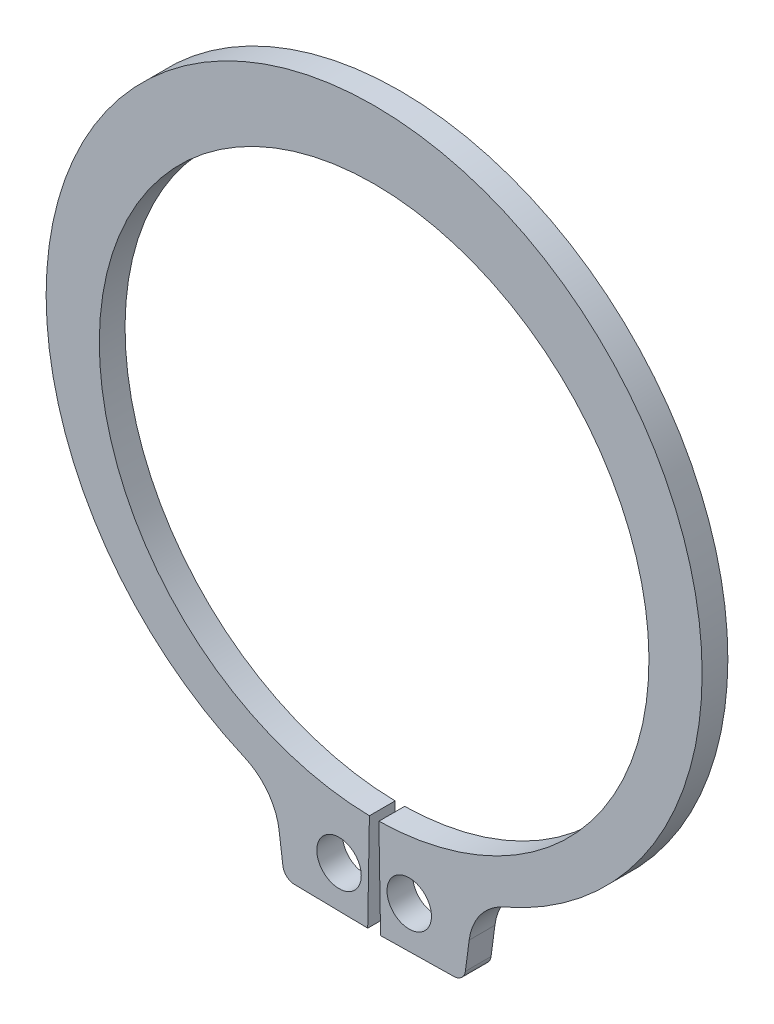
ISO-10303-21;
HEADER;
FILE_DESCRIPTION(('STEP AP214'),'2;1');
FILE_NAME('part.step','',(''),(''),'','','');
FILE_SCHEMA(('AUTOMOTIVE_DESIGN { 1 0 10303 214 1 1 1 1 }'));
ENDSEC;
DATA;
#1=APPLICATION_CONTEXT('core data for automotive mechanical design processes');
#2=APPLICATION_PROTOCOL_DEFINITION('international standard','automotive_design',2000,#1);
#3=PRODUCT_CONTEXT('',#1,'mechanical');
#4=PRODUCT('Part','Part','',(#3));
#5=PRODUCT_RELATED_PRODUCT_CATEGORY('part','',(#4));
#6=PRODUCT_DEFINITION_FORMATION('','',#4);
#7=PRODUCT_DEFINITION_CONTEXT('part definition',#1,'design');
#8=PRODUCT_DEFINITION('design','',#6,#7);
#9=PRODUCT_DEFINITION_SHAPE('','',#8);
#10=(LENGTH_UNIT() NAMED_UNIT(*) SI_UNIT(.MILLI.,.METRE.));
#11=(NAMED_UNIT(*) PLANE_ANGLE_UNIT() SI_UNIT($,.RADIAN.));
#12=(NAMED_UNIT(*) SI_UNIT($,.STERADIAN.) SOLID_ANGLE_UNIT());
#13=UNCERTAINTY_MEASURE_WITH_UNIT(LENGTH_MEASURE(1.E-05),#10,'distance_accuracy_value','');
#14=(GEOMETRIC_REPRESENTATION_CONTEXT(3) GLOBAL_UNCERTAINTY_ASSIGNED_CONTEXT((#13)) GLOBAL_UNIT_ASSIGNED_CONTEXT((#10,
#11,#12)) REPRESENTATION_CONTEXT('',''));
#15=CARTESIAN_POINT('',(0.,0.,0.));
#16=DIRECTION('',(0.,0.,1.));
#17=DIRECTION('',(1.,0.,0.));
#18=AXIS2_PLACEMENT_3D('',#15,#16,#17);
#19=CARTESIAN_POINT('',(0.,0.,-1.1));
#20=DIRECTION('',(0.,0.,1.));
#21=DIRECTION('',(1.,0.,0.));
#22=AXIS2_PLACEMENT_3D('',#19,#20,#21);
#23=CYLINDRICAL_SURFACE('',#22,11.75);
#24=CARTESIAN_POINT('',(0.,0.,0.));
#25=DIRECTION('',(0.,0.,-1.));
#26=DIRECTION('',(1.,0.,0.));
#27=AXIS2_PLACEMENT_3D('',#24,#25,#26);
#28=CIRCLE('',#27,11.75);
#29=CARTESIAN_POINT('',(-0.202586206896552,-11.7482534373742,0.));
#30=VERTEX_POINT('',#29);
#31=CARTESIAN_POINT('',(0.202586206896552,-11.7482534373742,0.));
#32=VERTEX_POINT('',#31);
#33=EDGE_CURVE('E155',#30,#32,#28,.T.);
#34=ORIENTED_EDGE('',*,*,#33,.F.);
#35=DIRECTION('',(0.,0.,1.));
#36=VECTOR('',#35,1.);
#37=CARTESIAN_POINT('',(-0.202586206896552,-11.7482534373742,-1.1));
#38=LINE('',#37,#36);
#39=CARTESIAN_POINT('',(-0.202586206896552,-11.7482534373742,-1.1));
#40=VERTEX_POINT('',#39);
#41=EDGE_CURVE('E11',#40,#30,#38,.T.);
#42=ORIENTED_EDGE('',*,*,#41,.F.);
#43=CARTESIAN_POINT('',(0.,0.,-1.1));
#44=DIRECTION('',(0.,0.,-1.));
#45=DIRECTION('',(1.,0.,0.));
#46=AXIS2_PLACEMENT_3D('',#43,#44,#45);
#47=CIRCLE('',#46,11.75);
#48=CARTESIAN_POINT('',(0.202586206896552,-11.7482534373742,-1.1));
#49=VERTEX_POINT('',#48);
#50=EDGE_CURVE('E188',#40,#49,#47,.T.);
#51=ORIENTED_EDGE('',*,*,#50,.T.);
#52=DIRECTION('',(0.,0.,1.));
#53=VECTOR('',#52,1.);
#54=CARTESIAN_POINT('',(0.202586206896552,-11.7482534373742,-1.1));
#55=LINE('',#54,#53);
#56=EDGE_CURVE('E37',#49,#32,#55,.T.);
#57=ORIENTED_EDGE('',*,*,#56,.T.);
#58=EDGE_LOOP('',(#34,#42,#51,#57));
#59=FACE_BOUND('',#58,.T.);
#60=ADVANCED_FACE('F34',(#59),#23,.F.);
#61=CARTESIAN_POINT('',(-0.202586206896552,-11.7482534373742,-1.1));
#62=DIRECTION('',(0.999851356372275,-0.0172413793103448,0.));
#63=DIRECTION('',(0.0172413793103448,0.999851356372275,0.));
#64=AXIS2_PLACEMENT_3D('',#61,#62,#63);
#65=PLANE('',#64);
#66=DIRECTION('',(0.0172413793103448,0.999851356372274,0.));
#67=VECTOR('',#66,1.);
#68=CARTESIAN_POINT('',(-0.202586206896552,-11.7482534373742,0.));
#69=LINE('',#68,#67);
#70=CARTESIAN_POINT('',(-0.275,-15.9476291341378,0.));
#71=VERTEX_POINT('',#70);
#72=EDGE_CURVE('E186',#71,#30,#69,.T.);
#73=ORIENTED_EDGE('',*,*,#72,.F.);
#74=DIRECTION('',(0.,0.,1.));
#75=VECTOR('',#74,1.);
#76=CARTESIAN_POINT('',(-0.275,-15.9476291341378,-1.1));
#77=LINE('',#76,#75);
#78=CARTESIAN_POINT('',(-0.275,-15.9476291341378,-1.1));
#79=VERTEX_POINT('',#78);
#80=EDGE_CURVE('E43',#79,#71,#77,.T.);
#81=ORIENTED_EDGE('',*,*,#80,.F.);
#82=DIRECTION('',(0.0172413793103448,0.999851356372274,0.));
#83=VECTOR('',#82,1.);
#84=CARTESIAN_POINT('',(-0.202586206896552,-11.7482534373742,-1.1));
#85=LINE('',#84,#83);
#86=EDGE_CURVE('E145',#79,#40,#85,.T.);
#87=ORIENTED_EDGE('',*,*,#86,.T.);
#88=ORIENTED_EDGE('',*,*,#41,.T.);
#89=EDGE_LOOP('',(#73,#81,#87,#88));
#90=FACE_BOUND('',#89,.T.);
#91=ADVANCED_FACE('F208',(#90),#65,.T.);
#92=CARTESIAN_POINT('',(-0.275,-15.9476291341378,-1.1));
#93=DIRECTION('',(-0.0172413793103457,-0.999851356372274,0.));
#94=DIRECTION('',(0.999851356372274,-0.0172413793103457,0.));
#95=AXIS2_PLACEMENT_3D('',#92,#93,#94);
#96=PLANE('',#95);
#97=DIRECTION('',(0.999851356372275,-0.0172413793103457,0.));
#98=VECTOR('',#97,1.);
#99=CARTESIAN_POINT('',(-0.275,-15.9476291341378,0.));
#100=LINE('',#99,#98);
#101=CARTESIAN_POINT('',(-3.41293614914244,-15.893518743574,0.));
#102=VERTEX_POINT('',#101);
#103=EDGE_CURVE('E132',#102,#71,#100,.T.);
#104=ORIENTED_EDGE('',*,*,#103,.F.);
#105=DIRECTION('',(0.,0.,1.));
#106=VECTOR('',#105,1.);
#107=CARTESIAN_POINT('',(-3.41293614914244,-15.893518743574,-1.1));
#108=LINE('',#107,#106);
#109=CARTESIAN_POINT('',(-3.41293614914244,-15.893518743574,-1.1));
#110=VERTEX_POINT('',#109);
#111=EDGE_CURVE('E127',#110,#102,#108,.T.);
#112=ORIENTED_EDGE('',*,*,#111,.F.);
#113=DIRECTION('',(0.999851356372275,-0.0172413793103457,0.));
#114=VECTOR('',#113,1.);
#115=CARTESIAN_POINT('',(-0.275,-15.9476291341378,-1.1));
#116=LINE('',#115,#114);
#117=EDGE_CURVE('E130',#110,#79,#116,.T.);
#118=ORIENTED_EDGE('',*,*,#117,.T.);
#119=ORIENTED_EDGE('',*,*,#80,.T.);
#120=EDGE_LOOP('',(#104,#112,#118,#119));
#121=FACE_BOUND('',#120,.T.);
#122=ADVANCED_FACE('F129',(#121),#96,.T.);
#123=CARTESIAN_POINT('',(-3.40431545948727,-15.3935930653879,-1.1));
#124=DIRECTION('',(0.,0.,1.));
#125=DIRECTION('',(1.,0.,0.));
#126=AXIS2_PLACEMENT_3D('',#123,#124,#125);
#127=CYLINDRICAL_SURFACE('',#126,0.499999999999998);
#128=CARTESIAN_POINT('',(-3.40431545948727,-15.3935930653879,0.));
#129=DIRECTION('',(0.,0.,1.));
#130=DIRECTION('',(1.,0.,0.));
#131=AXIS2_PLACEMENT_3D('',#128,#129,#130);
#132=CIRCLE('',#131,0.499999999999998);
#133=CARTESIAN_POINT('',(-3.90003789017417,-15.4588561614979,0.));
#134=VERTEX_POINT('',#133);
#135=EDGE_CURVE('E183',#134,#102,#132,.T.);
#136=ORIENTED_EDGE('',*,*,#135,.F.);
#137=DIRECTION('',(0.,0.,1.));
#138=VECTOR('',#137,1.);
#139=CARTESIAN_POINT('',(-3.90003789017417,-15.4588561614979,-1.1));
#140=LINE('',#139,#138);
#141=CARTESIAN_POINT('',(-3.90003789017417,-15.4588561614979,-1.1));
#142=VERTEX_POINT('',#141);
#143=EDGE_CURVE('E137',#142,#134,#140,.T.);
#144=ORIENTED_EDGE('',*,*,#143,.F.);
#145=CARTESIAN_POINT('',(-3.40431545948727,-15.3935930653879,-1.1));
#146=DIRECTION('',(0.,0.,1.));
#147=DIRECTION('',(1.,0.,0.));
#148=AXIS2_PLACEMENT_3D('',#145,#146,#147);
#149=CIRCLE('',#148,0.499999999999998);
#150=EDGE_CURVE('E143',#142,#110,#149,.T.);
#151=ORIENTED_EDGE('',*,*,#150,.T.);
#152=ORIENTED_EDGE('',*,*,#111,.T.);
#153=EDGE_LOOP('',(#136,#144,#151,#152));
#154=FACE_BOUND('',#153,.T.);
#155=ADVANCED_FACE('F147',(#154),#127,.T.);
#156=CARTESIAN_POINT('',(-4.06304644435679,-14.220683265656,-1.1));
#157=DIRECTION('',(-0.99144486137381,-0.130526192220051,0.));
#158=DIRECTION('',(0.130526192220051,-0.991444861373811,0.));
#159=AXIS2_PLACEMENT_3D('',#156,#157,#158);
#160=PLANE('',#159);
#161=DIRECTION('',(0.130526192220051,-0.99144486137381,0.));
#162=VECTOR('',#161,1.);
#163=CARTESIAN_POINT('',(-4.06304644435679,-14.220683265656,0.));
#164=LINE('',#163,#162);
#165=CARTESIAN_POINT('',(-4.06304644435679,-14.220683265656,0.));
#166=VERTEX_POINT('',#165);
#167=EDGE_CURVE('E180',#166,#134,#164,.T.);
#168=ORIENTED_EDGE('',*,*,#167,.F.);
#169=DIRECTION('',(0.,0.,1.));
#170=VECTOR('',#169,1.);
#171=CARTESIAN_POINT('',(-4.06304644435679,-14.220683265656,-1.1));
#172=LINE('',#171,#170);
#173=CARTESIAN_POINT('',(-4.06304644435679,-14.220683265656,-1.1));
#174=VERTEX_POINT('',#173);
#175=EDGE_CURVE('E192',#174,#166,#172,.T.);
#176=ORIENTED_EDGE('',*,*,#175,.F.);
#177=DIRECTION('',(0.130526192220051,-0.99144486137381,0.));
#178=VECTOR('',#177,1.);
#179=CARTESIAN_POINT('',(-4.06304644435679,-14.220683265656,-1.1));
#180=LINE('',#179,#178);
#181=EDGE_CURVE('E148',#174,#142,#180,.T.);
#182=ORIENTED_EDGE('',*,*,#181,.T.);
#183=ORIENTED_EDGE('',*,*,#143,.T.);
#184=EDGE_LOOP('',(#168,#176,#182,#183));
#185=FACE_BOUND('',#184,.T.);
#186=ADVANCED_FACE('F221',(#185),#160,.T.);
#187=CARTESIAN_POINT('',(-6.54130563604714,-14.5469522779109,-1.1));
#188=DIRECTION('',(0.,0.,1.));
#189=DIRECTION('',(1.,0.,0.));
#190=AXIS2_PLACEMENT_3D('',#187,#188,#189);
#191=CYLINDRICAL_SURFACE('',#190,2.49964399256286);
#192=CARTESIAN_POINT('',(-6.54130563604714,-14.5469522779109,0.));
#193=DIRECTION('',(0.,0.,-1.));
#194=DIRECTION('',(1.,0.,0.));
#195=AXIS2_PLACEMENT_3D('',#192,#193,#194);
#196=CIRCLE('',#195,2.49964399256286);
#197=CARTESIAN_POINT('',(-5.55173550673059,-12.2515283413101,0.));
#198=VERTEX_POINT('',#197);
#199=EDGE_CURVE('E177',#198,#166,#196,.T.);
#200=ORIENTED_EDGE('',*,*,#199,.F.);
#201=DIRECTION('',(0.,0.,1.));
#202=VECTOR('',#201,1.);
#203=CARTESIAN_POINT('',(-5.55173550673059,-12.2515283413101,-1.1));
#204=LINE('',#203,#202);
#205=CARTESIAN_POINT('',(-5.55173550673059,-12.2515283413101,-1.1));
#206=VERTEX_POINT('',#205);
#207=EDGE_CURVE('E194',#206,#198,#204,.T.);
#208=ORIENTED_EDGE('',*,*,#207,.F.);
#209=CARTESIAN_POINT('',(-6.54130563604714,-14.5469522779109,-1.1));
#210=DIRECTION('',(0.,0.,-1.));
#211=DIRECTION('',(1.,0.,0.));
#212=AXIS2_PLACEMENT_3D('',#209,#210,#211);
#213=CIRCLE('',#212,2.49964399256286);
#214=EDGE_CURVE('E150',#206,#174,#213,.T.);
#215=ORIENTED_EDGE('',*,*,#214,.T.);
#216=ORIENTED_EDGE('',*,*,#175,.T.);
#217=EDGE_LOOP('',(#200,#208,#215,#216));
#218=FACE_BOUND('',#217,.T.);
#219=ADVANCED_FACE('F224',(#218),#191,.F.);
#220=CARTESIAN_POINT('',(0.,0.626373076982971,-1.1));
#221=DIRECTION('',(0.,0.,1.));
#222=DIRECTION('',(1.,0.,0.));
#223=AXIS2_PLACEMENT_3D('',#220,#221,#222);
#224=CYLINDRICAL_SURFACE('',#223,14.023626923017);
#225=CARTESIAN_POINT('',(0.,0.626373076982971,0.));
#226=DIRECTION('',(0.,0.,1.));
#227=DIRECTION('',(1.,0.,0.));
#228=AXIS2_PLACEMENT_3D('',#225,#226,#227);
#229=CIRCLE('',#228,14.023626923017);
#230=CARTESIAN_POINT('',(5.55173550673059,-12.2515283413101,0.));
#231=VERTEX_POINT('',#230);
#232=EDGE_CURVE('E174',#231,#198,#229,.T.);
#233=ORIENTED_EDGE('',*,*,#232,.F.);
#234=DIRECTION('',(0.,0.,1.));
#235=VECTOR('',#234,1.);
#236=CARTESIAN_POINT('',(5.55173550673059,-12.2515283413101,-1.1));
#237=LINE('',#236,#235);
#238=CARTESIAN_POINT('',(5.55173550673059,-12.2515283413101,-1.1));
#239=VERTEX_POINT('',#238);
#240=EDGE_CURVE('E196',#239,#231,#237,.T.);
#241=ORIENTED_EDGE('',*,*,#240,.F.);
#242=CARTESIAN_POINT('',(0.,0.626373076982971,-1.1));
#243=DIRECTION('',(0.,0.,1.));
#244=DIRECTION('',(1.,0.,0.));
#245=AXIS2_PLACEMENT_3D('',#242,#243,#244);
#246=CIRCLE('',#245,14.023626923017);
#247=EDGE_CURVE('E298',#239,#206,#246,.T.);
#248=ORIENTED_EDGE('',*,*,#247,.T.);
#249=ORIENTED_EDGE('',*,*,#207,.T.);
#250=EDGE_LOOP('',(#233,#241,#248,#249));
#251=FACE_BOUND('',#250,.T.);
#252=ADVANCED_FACE('F228',(#251),#224,.T.);
#253=CARTESIAN_POINT('',(6.54130563604714,-14.5469522779109,-1.1));
#254=DIRECTION('',(0.,0.,1.));
#255=DIRECTION('',(1.,0.,0.));
#256=AXIS2_PLACEMENT_3D('',#253,#254,#255);
#257=CYLINDRICAL_SURFACE('',#256,2.49964399256286);
#258=CARTESIAN_POINT('',(6.54130563604714,-14.5469522779109,0.));
#259=DIRECTION('',(0.,0.,-1.));
#260=DIRECTION('',(1.,0.,0.));
#261=AXIS2_PLACEMENT_3D('',#258,#259,#260);
#262=CIRCLE('',#261,2.49964399256286);
#263=CARTESIAN_POINT('',(4.06304644435678,-14.220683265656,0.));
#264=VERTEX_POINT('',#263);
#265=EDGE_CURVE('E171',#264,#231,#262,.T.);
#266=ORIENTED_EDGE('',*,*,#265,.F.);
#267=DIRECTION('',(0.,0.,1.));
#268=VECTOR('',#267,1.);
#269=CARTESIAN_POINT('',(4.06304644435678,-14.220683265656,-1.1));
#270=LINE('',#269,#268);
#271=CARTESIAN_POINT('',(4.06304644435678,-14.220683265656,-1.1));
#272=VERTEX_POINT('',#271);
#273=EDGE_CURVE('E198',#272,#264,#270,.T.);
#274=ORIENTED_EDGE('',*,*,#273,.F.);
#275=CARTESIAN_POINT('',(6.54130563604714,-14.5469522779109,-1.1));
#276=DIRECTION('',(0.,0.,-1.));
#277=DIRECTION('',(1.,0.,0.));
#278=AXIS2_PLACEMENT_3D('',#275,#276,#277);
#279=CIRCLE('',#278,2.49964399256286);
#280=EDGE_CURVE('E295',#272,#239,#279,.T.);
#281=ORIENTED_EDGE('',*,*,#280,.T.);
#282=ORIENTED_EDGE('',*,*,#240,.T.);
#283=EDGE_LOOP('',(#266,#274,#281,#282));
#284=FACE_BOUND('',#283,.T.);
#285=ADVANCED_FACE('F232',(#284),#257,.F.);
#286=CARTESIAN_POINT('',(4.06304644435678,-14.220683265656,-1.1));
#287=DIRECTION('',(0.991444861373811,-0.13052619222005,0.));
#288=DIRECTION('',(0.13052619222005,0.991444861373811,0.));
#289=AXIS2_PLACEMENT_3D('',#286,#287,#288);
#290=PLANE('',#289);
#291=DIRECTION('',(0.13052619222005,0.991444861373811,0.));
#292=VECTOR('',#291,1.);
#293=CARTESIAN_POINT('',(4.06304644435678,-14.220683265656,0.));
#294=LINE('',#293,#292);
#295=CARTESIAN_POINT('',(3.90003789017418,-15.4588561614979,0.));
#296=VERTEX_POINT('',#295);
#297=EDGE_CURVE('E168',#296,#264,#294,.T.);
#298=ORIENTED_EDGE('',*,*,#297,.F.);
#299=DIRECTION('',(0.,0.,1.));
#300=VECTOR('',#299,1.);
#301=CARTESIAN_POINT('',(3.90003789017418,-15.4588561614979,-1.1));
#302=LINE('',#301,#300);
#303=CARTESIAN_POINT('',(3.90003789017418,-15.4588561614979,-1.1));
#304=VERTEX_POINT('',#303);
#305=EDGE_CURVE('E200',#304,#296,#302,.T.);
#306=ORIENTED_EDGE('',*,*,#305,.F.);
#307=DIRECTION('',(0.13052619222005,0.991444861373811,0.));
#308=VECTOR('',#307,1.);
#309=CARTESIAN_POINT('',(4.06304644435678,-14.220683265656,-1.1));
#310=LINE('',#309,#308);
#311=EDGE_CURVE('E292',#304,#272,#310,.T.);
#312=ORIENTED_EDGE('',*,*,#311,.T.);
#313=ORIENTED_EDGE('',*,*,#273,.T.);
#314=EDGE_LOOP('',(#298,#306,#312,#313));
#315=FACE_BOUND('',#314,.T.);
#316=ADVANCED_FACE('F236',(#315),#290,.T.);
#317=CARTESIAN_POINT('',(3.40431545948727,-15.3935930653879,-1.1));
#318=DIRECTION('',(0.,0.,1.));
#319=DIRECTION('',(1.,0.,0.));
#320=AXIS2_PLACEMENT_3D('',#317,#318,#319);
#321=CYLINDRICAL_SURFACE('',#320,0.499999999999998);
#322=CARTESIAN_POINT('',(3.40431545948727,-15.3935930653879,0.));
#323=DIRECTION('',(0.,0.,1.));
#324=DIRECTION('',(-1.,0.,0.));
#325=AXIS2_PLACEMENT_3D('',#322,#323,#324);
#326=CIRCLE('',#325,0.499999999999998);
#327=CARTESIAN_POINT('',(3.41293614914244,-15.893518743574,0.));
#328=VERTEX_POINT('',#327);
#329=EDGE_CURVE('E165',#328,#296,#326,.T.);
#330=ORIENTED_EDGE('',*,*,#329,.F.);
#331=DIRECTION('',(0.,0.,1.));
#332=VECTOR('',#331,1.);
#333=CARTESIAN_POINT('',(3.41293614914244,-15.893518743574,-1.1));
#334=LINE('',#333,#332);
#335=CARTESIAN_POINT('',(3.41293614914244,-15.893518743574,-1.1));
#336=VERTEX_POINT('',#335);
#337=EDGE_CURVE('E202',#336,#328,#334,.T.);
#338=ORIENTED_EDGE('',*,*,#337,.F.);
#339=CARTESIAN_POINT('',(3.40431545948727,-15.3935930653879,-1.1));
#340=DIRECTION('',(0.,0.,1.));
#341=DIRECTION('',(-1.,0.,0.));
#342=AXIS2_PLACEMENT_3D('',#339,#340,#341);
#343=CIRCLE('',#342,0.499999999999998);
#344=EDGE_CURVE('E289',#336,#304,#343,.T.);
#345=ORIENTED_EDGE('',*,*,#344,.T.);
#346=ORIENTED_EDGE('',*,*,#305,.T.);
#347=EDGE_LOOP('',(#330,#338,#345,#346));
#348=FACE_BOUND('',#347,.T.);
#349=ADVANCED_FACE('F240',(#348),#321,.T.);
#350=CARTESIAN_POINT('',(0.275,-15.9476291341378,-1.1));
#351=DIRECTION('',(0.0172413793103457,-0.999851356372274,0.));
#352=DIRECTION('',(0.999851356372274,0.0172413793103457,0.));
#353=AXIS2_PLACEMENT_3D('',#350,#351,#352);
#354=PLANE('',#353);
#355=DIRECTION('',(0.999851356372275,0.0172413793103457,0.));
#356=VECTOR('',#355,1.);
#357=CARTESIAN_POINT('',(0.275,-15.9476291341378,0.));
#358=LINE('',#357,#356);
#359=CARTESIAN_POINT('',(0.275,-15.9476291341378,0.));
#360=VERTEX_POINT('',#359);
#361=EDGE_CURVE('E162',#360,#328,#358,.T.);
#362=ORIENTED_EDGE('',*,*,#361,.F.);
#363=DIRECTION('',(0.,0.,1.));
#364=VECTOR('',#363,1.);
#365=CARTESIAN_POINT('',(0.275,-15.9476291341378,-1.1));
#366=LINE('',#365,#364);
#367=CARTESIAN_POINT('',(0.275,-15.9476291341378,-1.1));
#368=VERTEX_POINT('',#367);
#369=EDGE_CURVE('E203',#368,#360,#366,.T.);
#370=ORIENTED_EDGE('',*,*,#369,.F.);
#371=DIRECTION('',(0.999851356372275,0.0172413793103457,0.));
#372=VECTOR('',#371,1.);
#373=CARTESIAN_POINT('',(0.275,-15.9476291341378,-1.1));
#374=LINE('',#373,#372);
#375=EDGE_CURVE('E286',#368,#336,#374,.T.);
#376=ORIENTED_EDGE('',*,*,#375,.T.);
#377=ORIENTED_EDGE('',*,*,#337,.T.);
#378=EDGE_LOOP('',(#362,#370,#376,#377));
#379=FACE_BOUND('',#378,.T.);
#380=ADVANCED_FACE('F244',(#379),#354,.T.);
#381=CARTESIAN_POINT('',(0.202586206896552,-11.7482534373742,-1.1));
#382=DIRECTION('',(-0.999851356372275,-0.0172413793103448,0.));
#383=DIRECTION('',(0.0172413793103448,-0.999851356372275,0.));
#384=AXIS2_PLACEMENT_3D('',#381,#382,#383);
#385=PLANE('',#384);
#386=DIRECTION('',(0.0172413793103448,-0.999851356372274,0.));
#387=VECTOR('',#386,1.);
#388=CARTESIAN_POINT('',(0.202586206896552,-11.7482534373742,0.));
#389=LINE('',#388,#387);
#390=EDGE_CURVE('E158',#32,#360,#389,.T.);
#391=ORIENTED_EDGE('',*,*,#390,.F.);
#392=ORIENTED_EDGE('',*,*,#56,.F.);
#393=DIRECTION('',(0.0172413793103448,-0.999851356372274,0.));
#394=VECTOR('',#393,1.);
#395=CARTESIAN_POINT('',(0.202586206896552,-11.7482534373742,-1.1));
#396=LINE('',#395,#394);
#397=EDGE_CURVE('E284',#49,#368,#396,.T.);
#398=ORIENTED_EDGE('',*,*,#397,.T.);
#399=ORIENTED_EDGE('',*,*,#369,.T.);
#400=EDGE_LOOP('',(#391,#392,#398,#399));
#401=FACE_BOUND('',#400,.T.);
#402=ADVANCED_FACE('F205',(#401),#385,.T.);
#403=CARTESIAN_POINT('',(0.,0.,-1.1));
#404=DIRECTION('',(0.,0.,1.));
#405=DIRECTION('',(1.,0.,0.));
#406=AXIS2_PLACEMENT_3D('',#403,#404,#405);
#407=PLANE('',#406);
#408=CARTESIAN_POINT('',(-1.5,-14.1456928073531,-1.1));
#409=DIRECTION('',(0.,0.,1.));
#410=DIRECTION('',(1.,0.,0.));
#411=AXIS2_PLACEMENT_3D('',#408,#409,#410);
#412=CIRCLE('',#411,0.95);
#413=CARTESIAN_POINT('',(-0.55,-14.1456928073531,-1.1));
#414=VERTEX_POINT('',#413);
#415=EDGE_CURVE('E271',#414,#414,#412,.T.);
#416=ORIENTED_EDGE('',*,*,#415,.T.);
#417=EDGE_LOOP('',(#416));
#418=FACE_BOUND('',#417,.T.);
#419=CARTESIAN_POINT('',(1.5,-14.1456928073531,-1.1));
#420=DIRECTION('',(0.,0.,1.));
#421=DIRECTION('',(1.,0.,0.));
#422=AXIS2_PLACEMENT_3D('',#419,#420,#421);
#423=CIRCLE('',#422,0.95);
#424=CARTESIAN_POINT('',(2.45,-14.1456928073531,-1.1));
#425=VERTEX_POINT('',#424);
#426=EDGE_CURVE('E159',#425,#425,#423,.T.);
#427=ORIENTED_EDGE('',*,*,#426,.T.);
#428=EDGE_LOOP('',(#427));
#429=FACE_BOUND('',#428,.T.);
#430=ORIENTED_EDGE('',*,*,#50,.F.);
#431=ORIENTED_EDGE('',*,*,#86,.F.);
#432=ORIENTED_EDGE('',*,*,#117,.F.);
#433=ORIENTED_EDGE('',*,*,#150,.F.);
#434=ORIENTED_EDGE('',*,*,#181,.F.);
#435=ORIENTED_EDGE('',*,*,#214,.F.);
#436=ORIENTED_EDGE('',*,*,#247,.F.);
#437=ORIENTED_EDGE('',*,*,#280,.F.);
#438=ORIENTED_EDGE('',*,*,#311,.F.);
#439=ORIENTED_EDGE('',*,*,#344,.F.);
#440=ORIENTED_EDGE('',*,*,#375,.F.);
#441=ORIENTED_EDGE('',*,*,#397,.F.);
#442=EDGE_LOOP('',(#430,#431,#432,#433,#434,#435,#436,#437,#438,#439,#440,#441));
#443=FACE_BOUND('',#442,.T.);
#444=ADVANCED_FACE('F141',(#418,#429,#443),#407,.F.);
#445=CARTESIAN_POINT('',(0.,0.,0.));
#446=DIRECTION('',(0.,0.,1.));
#447=DIRECTION('',(1.,0.,0.));
#448=AXIS2_PLACEMENT_3D('',#445,#446,#447);
#449=PLANE('',#448);
#450=CARTESIAN_POINT('',(-1.5,-14.1456928073531,0.));
#451=DIRECTION('',(0.,0.,1.));
#452=DIRECTION('',(1.,0.,0.));
#453=AXIS2_PLACEMENT_3D('',#450,#451,#452);
#454=CIRCLE('',#453,0.95);
#455=CARTESIAN_POINT('',(-0.55,-14.1456928073531,0.));
#456=VERTEX_POINT('',#455);
#457=EDGE_CURVE('E274',#456,#456,#454,.T.);
#458=ORIENTED_EDGE('',*,*,#457,.F.);
#459=EDGE_LOOP('',(#458));
#460=FACE_BOUND('',#459,.T.);
#461=CARTESIAN_POINT('',(1.5,-14.1456928073531,0.));
#462=DIRECTION('',(0.,0.,1.));
#463=DIRECTION('',(1.,0.,0.));
#464=AXIS2_PLACEMENT_3D('',#461,#462,#463);
#465=CIRCLE('',#464,0.95);
#466=CARTESIAN_POINT('',(2.45,-14.1456928073531,0.));
#467=VERTEX_POINT('',#466);
#468=EDGE_CURVE('E276',#467,#467,#465,.T.);
#469=ORIENTED_EDGE('',*,*,#468,.F.);
#470=EDGE_LOOP('',(#469));
#471=FACE_BOUND('',#470,.T.);
#472=ORIENTED_EDGE('',*,*,#33,.T.);
#473=ORIENTED_EDGE('',*,*,#390,.T.);
#474=ORIENTED_EDGE('',*,*,#361,.T.);
#475=ORIENTED_EDGE('',*,*,#329,.T.);
#476=ORIENTED_EDGE('',*,*,#297,.T.);
#477=ORIENTED_EDGE('',*,*,#265,.T.);
#478=ORIENTED_EDGE('',*,*,#232,.T.);
#479=ORIENTED_EDGE('',*,*,#199,.T.);
#480=ORIENTED_EDGE('',*,*,#167,.T.);
#481=ORIENTED_EDGE('',*,*,#135,.T.);
#482=ORIENTED_EDGE('',*,*,#103,.T.);
#483=ORIENTED_EDGE('',*,*,#72,.T.);
#484=EDGE_LOOP('',(#472,#473,#474,#475,#476,#477,#478,#479,#480,#481,#482,#483));
#485=FACE_BOUND('',#484,.T.);
#486=ADVANCED_FACE('F207',(#460,#471,#485),#449,.T.);
#487=CARTESIAN_POINT('',(1.5,-14.1456928073531,-1.1));
#488=DIRECTION('',(0.,0.,1.));
#489=DIRECTION('',(1.,0.,0.));
#490=AXIS2_PLACEMENT_3D('',#487,#488,#489);
#491=CYLINDRICAL_SURFACE('',#490,0.95);
#492=ORIENTED_EDGE('',*,*,#426,.F.);
#493=EDGE_LOOP('',(#492));
#494=FACE_BOUND('',#493,.T.);
#495=ORIENTED_EDGE('',*,*,#468,.T.);
#496=EDGE_LOOP('',(#495));
#497=FACE_BOUND('',#496,.T.);
#498=ADVANCED_FACE('F256',(#494,#497),#491,.F.);
#499=CARTESIAN_POINT('',(-1.5,-14.1456928073531,-1.1));
#500=DIRECTION('',(0.,0.,1.));
#501=DIRECTION('',(1.,0.,0.));
#502=AXIS2_PLACEMENT_3D('',#499,#500,#501);
#503=CYLINDRICAL_SURFACE('',#502,0.95);
#504=ORIENTED_EDGE('',*,*,#415,.F.);
#505=EDGE_LOOP('',(#504));
#506=FACE_BOUND('',#505,.T.);
#507=ORIENTED_EDGE('',*,*,#457,.T.);
#508=EDGE_LOOP('',(#507));
#509=FACE_BOUND('',#508,.T.);
#510=ADVANCED_FACE('F263',(#506,#509),#503,.F.);
#511=CLOSED_SHELL('',(#60,#91,#122,#155,#186,#219,#252,#285,#316,#349,#380,#402,#444,#486,#498,#510));
#512=MANIFOLD_SOLID_BREP('B2',#511);
#513=ADVANCED_BREP_SHAPE_REPRESENTATION('',(#18,#512),#14);
#514=SHAPE_DEFINITION_REPRESENTATION(#9,#513);
ENDSEC;
END-ISO-10303-21;
